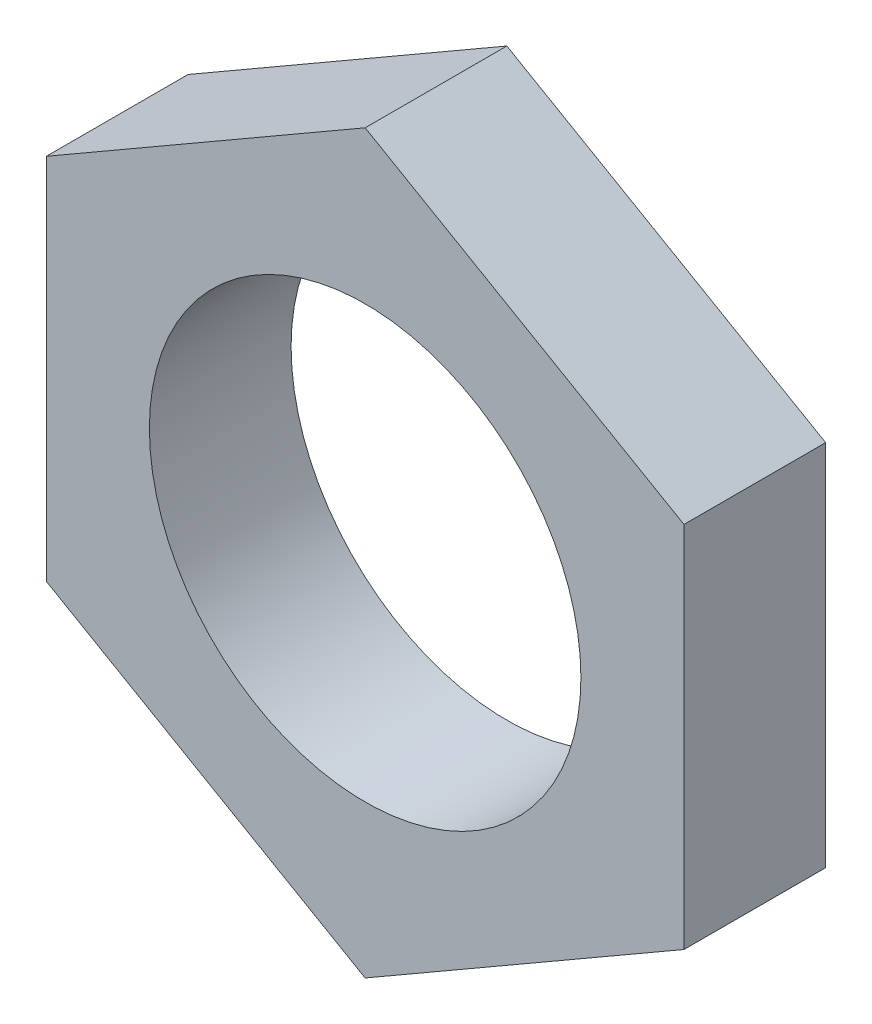
ISO-10303-21;
HEADER;
FILE_DESCRIPTION(('STEP AP214'),'2;1');
FILE_NAME('part.step','',(''),(''),'','','');
FILE_SCHEMA(('AUTOMOTIVE_DESIGN { 1 0 10303 214 1 1 1 1 }'));
ENDSEC;
DATA;
#1=APPLICATION_CONTEXT('core data for automotive mechanical design processes');
#2=APPLICATION_PROTOCOL_DEFINITION('international standard','automotive_design',2000,#1);
#3=PRODUCT_CONTEXT('',#1,'mechanical');
#4=PRODUCT('Part','Part','',(#3));
#5=PRODUCT_RELATED_PRODUCT_CATEGORY('part','',(#4));
#6=PRODUCT_DEFINITION_FORMATION('','',#4);
#7=PRODUCT_DEFINITION_CONTEXT('part definition',#1,'design');
#8=PRODUCT_DEFINITION('design','',#6,#7);
#9=PRODUCT_DEFINITION_SHAPE('','',#8);
#10=(LENGTH_UNIT() NAMED_UNIT(*) SI_UNIT(.MILLI.,.METRE.));
#11=(NAMED_UNIT(*) PLANE_ANGLE_UNIT() SI_UNIT($,.RADIAN.));
#12=(NAMED_UNIT(*) SI_UNIT($,.STERADIAN.) SOLID_ANGLE_UNIT());
#13=UNCERTAINTY_MEASURE_WITH_UNIT(LENGTH_MEASURE(1.E-05),#10,'distance_accuracy_value','');
#14=(GEOMETRIC_REPRESENTATION_CONTEXT(3) GLOBAL_UNCERTAINTY_ASSIGNED_CONTEXT((#13)) GLOBAL_UNIT_ASSIGNED_CONTEXT((#10,
#11,#12)) REPRESENTATION_CONTEXT('',''));
#15=CARTESIAN_POINT('',(0.,0.,0.));
#16=DIRECTION('',(0.,0.,1.));
#17=DIRECTION('',(1.,0.,0.));
#18=AXIS2_PLACEMENT_3D('',#15,#16,#17);
#19=CARTESIAN_POINT('',(0.,0.,2.2));
#20=DIRECTION('',(0.,0.,1.));
#21=DIRECTION('',(1.,0.,0.));
#22=AXIS2_PLACEMENT_3D('',#19,#20,#21);
#23=PLANE('',#22);
#24=DIRECTION('',(0.,1.,0.));
#25=VECTOR('',#24,1.);
#26=CARTESIAN_POINT('',(4.95,-2.85788383248865,2.2));
#27=LINE('',#26,#25);
#28=CARTESIAN_POINT('',(4.95,-2.85788383248865,2.2));
#29=VERTEX_POINT('',#28);
#30=CARTESIAN_POINT('',(4.95,2.85788383248865,2.2));
#31=VERTEX_POINT('',#30);
#32=EDGE_CURVE('E137',#29,#31,#27,.T.);
#33=ORIENTED_EDGE('',*,*,#32,.T.);
#34=DIRECTION('',(-0.866025403784439,0.5,0.));
#35=VECTOR('',#34,1.);
#36=CARTESIAN_POINT('',(4.95,2.85788383248865,2.2));
#37=LINE('',#36,#35);
#38=CARTESIAN_POINT('',(0.,5.7157676649773,2.2));
#39=VERTEX_POINT('',#38);
#40=EDGE_CURVE('E95',#31,#39,#37,.T.);
#41=ORIENTED_EDGE('',*,*,#40,.T.);
#42=DIRECTION('',(-0.866025403784438,-0.5,0.));
#43=VECTOR('',#42,1.);
#44=CARTESIAN_POINT('',(0.,5.7157676649773,2.2));
#45=LINE('',#44,#43);
#46=CARTESIAN_POINT('',(-4.95,2.85788383248865,2.2));
#47=VERTEX_POINT('',#46);
#48=EDGE_CURVE('E108',#39,#47,#45,.T.);
#49=ORIENTED_EDGE('',*,*,#48,.T.);
#50=DIRECTION('',(0.,-1.,0.));
#51=VECTOR('',#50,1.);
#52=CARTESIAN_POINT('',(-4.95,2.85788383248865,2.2));
#53=LINE('',#52,#51);
#54=CARTESIAN_POINT('',(-4.95,-2.85788383248865,2.2));
#55=VERTEX_POINT('',#54);
#56=EDGE_CURVE('E102',#47,#55,#53,.T.);
#57=ORIENTED_EDGE('',*,*,#56,.T.);
#58=DIRECTION('',(0.866025403784439,-0.5,0.));
#59=VECTOR('',#58,1.);
#60=CARTESIAN_POINT('',(-4.95,-2.85788383248865,2.2));
#61=LINE('',#60,#59);
#62=CARTESIAN_POINT('',(0.,-5.7157676649773,2.2));
#63=VERTEX_POINT('',#62);
#64=EDGE_CURVE('E106',#55,#63,#61,.T.);
#65=ORIENTED_EDGE('',*,*,#64,.T.);
#66=DIRECTION('',(0.866025403784439,0.5,0.));
#67=VECTOR('',#66,1.);
#68=CARTESIAN_POINT('',(0.,-5.7157676649773,2.2));
#69=LINE('',#68,#67);
#70=EDGE_CURVE('E58',#63,#29,#69,.T.);
#71=ORIENTED_EDGE('',*,*,#70,.T.);
#72=EDGE_LOOP('',(#33,#41,#49,#57,#65,#71));
#73=FACE_BOUND('',#72,.T.);
#74=CARTESIAN_POINT('',(0.,0.,2.2));
#75=DIRECTION('',(0.,0.,1.));
#76=DIRECTION('',(1.,0.,0.));
#77=AXIS2_PLACEMENT_3D('',#74,#75,#76);
#78=CIRCLE('',#77,3.35);
#79=CARTESIAN_POINT('',(3.35,0.,2.2));
#80=VERTEX_POINT('',#79);
#81=EDGE_CURVE('E130',#80,#80,#78,.T.);
#82=ORIENTED_EDGE('',*,*,#81,.F.);
#83=EDGE_LOOP('',(#82));
#84=FACE_BOUND('',#83,.T.);
#85=ADVANCED_FACE('F41',(#73,#84),#23,.T.);
#86=CARTESIAN_POINT('',(0.,0.,0.));
#87=DIRECTION('',(0.,0.,1.));
#88=DIRECTION('',(1.,0.,0.));
#89=AXIS2_PLACEMENT_3D('',#86,#87,#88);
#90=PLANE('',#89);
#91=DIRECTION('',(0.,1.,0.));
#92=VECTOR('',#91,1.);
#93=CARTESIAN_POINT('',(4.95,-2.85788383248865,0.));
#94=LINE('',#93,#92);
#95=CARTESIAN_POINT('',(4.95,-2.85788383248865,0.));
#96=VERTEX_POINT('',#95);
#97=CARTESIAN_POINT('',(4.95,2.85788383248865,0.));
#98=VERTEX_POINT('',#97);
#99=EDGE_CURVE('E126',#96,#98,#94,.T.);
#100=ORIENTED_EDGE('',*,*,#99,.F.);
#101=DIRECTION('',(0.866025403784439,0.5,0.));
#102=VECTOR('',#101,1.);
#103=CARTESIAN_POINT('',(0.,-5.7157676649773,0.));
#104=LINE('',#103,#102);
#105=CARTESIAN_POINT('',(0.,-5.7157676649773,0.));
#106=VERTEX_POINT('',#105);
#107=EDGE_CURVE('E87',#106,#96,#104,.T.);
#108=ORIENTED_EDGE('',*,*,#107,.F.);
#109=DIRECTION('',(0.866025403784439,-0.5,0.));
#110=VECTOR('',#109,1.);
#111=CARTESIAN_POINT('',(-4.95,-2.85788383248865,0.));
#112=LINE('',#111,#110);
#113=CARTESIAN_POINT('',(-4.95,-2.85788383248865,0.));
#114=VERTEX_POINT('',#113);
#115=EDGE_CURVE('E81',#114,#106,#112,.T.);
#116=ORIENTED_EDGE('',*,*,#115,.F.);
#117=DIRECTION('',(0.,-1.,0.));
#118=VECTOR('',#117,1.);
#119=CARTESIAN_POINT('',(-4.95,2.85788383248865,0.));
#120=LINE('',#119,#118);
#121=CARTESIAN_POINT('',(-4.95,2.85788383248865,0.));
#122=VERTEX_POINT('',#121);
#123=EDGE_CURVE('E116',#122,#114,#120,.T.);
#124=ORIENTED_EDGE('',*,*,#123,.F.);
#125=DIRECTION('',(-0.866025403784438,-0.5,0.));
#126=VECTOR('',#125,1.);
#127=CARTESIAN_POINT('',(0.,5.7157676649773,0.));
#128=LINE('',#127,#126);
#129=CARTESIAN_POINT('',(0.,5.7157676649773,0.));
#130=VERTEX_POINT('',#129);
#131=EDGE_CURVE('E132',#130,#122,#128,.T.);
#132=ORIENTED_EDGE('',*,*,#131,.F.);
#133=DIRECTION('',(-0.866025403784439,0.5,0.));
#134=VECTOR('',#133,1.);
#135=CARTESIAN_POINT('',(4.95,2.85788383248865,0.));
#136=LINE('',#135,#134);
#137=EDGE_CURVE('E129',#98,#130,#136,.T.);
#138=ORIENTED_EDGE('',*,*,#137,.F.);
#139=EDGE_LOOP('',(#100,#108,#116,#124,#132,#138));
#140=FACE_BOUND('',#139,.T.);
#141=CARTESIAN_POINT('',(0.,0.,0.));
#142=DIRECTION('',(0.,0.,1.));
#143=DIRECTION('',(1.,0.,0.));
#144=AXIS2_PLACEMENT_3D('',#141,#142,#143);
#145=CIRCLE('',#144,3.35);
#146=CARTESIAN_POINT('',(3.35,0.,0.));
#147=VERTEX_POINT('',#146);
#148=EDGE_CURVE('E236',#147,#147,#145,.T.);
#149=ORIENTED_EDGE('',*,*,#148,.T.);
#150=EDGE_LOOP('',(#149));
#151=FACE_BOUND('',#150,.T.);
#152=ADVANCED_FACE('F146',(#140,#151),#90,.F.);
#153=CARTESIAN_POINT('',(4.95,-2.85788383248865,2.2));
#154=DIRECTION('',(-1.,0.,0.));
#155=DIRECTION('',(0.,-1.,0.));
#156=AXIS2_PLACEMENT_3D('',#153,#154,#155);
#157=PLANE('',#156);
#158=ORIENTED_EDGE('',*,*,#99,.T.);
#159=DIRECTION('',(0.,0.,-1.));
#160=VECTOR('',#159,1.);
#161=CARTESIAN_POINT('',(4.95,2.85788383248865,2.2));
#162=LINE('',#161,#160);
#163=EDGE_CURVE('E11',#31,#98,#162,.T.);
#164=ORIENTED_EDGE('',*,*,#163,.F.);
#165=ORIENTED_EDGE('',*,*,#32,.F.);
#166=DIRECTION('',(0.,0.,-1.));
#167=VECTOR('',#166,1.);
#168=CARTESIAN_POINT('',(4.95,-2.85788383248865,2.2));
#169=LINE('',#168,#167);
#170=EDGE_CURVE('E122',#29,#96,#169,.T.);
#171=ORIENTED_EDGE('',*,*,#170,.T.);
#172=EDGE_LOOP('',(#158,#164,#165,#171));
#173=FACE_BOUND('',#172,.T.);
#174=ADVANCED_FACE('F43',(#173),#157,.F.);
#175=CARTESIAN_POINT('',(4.95,2.85788383248865,2.2));
#176=DIRECTION('',(-0.5,-0.866025403784439,0.));
#177=DIRECTION('',(0.866025403784439,-0.5,0.));
#178=AXIS2_PLACEMENT_3D('',#175,#176,#177);
#179=PLANE('',#178);
#180=ORIENTED_EDGE('',*,*,#137,.T.);
#181=DIRECTION('',(0.,0.,-1.));
#182=VECTOR('',#181,1.);
#183=CARTESIAN_POINT('',(0.,5.7157676649773,2.2));
#184=LINE('',#183,#182);
#185=EDGE_CURVE('E50',#39,#130,#184,.T.);
#186=ORIENTED_EDGE('',*,*,#185,.F.);
#187=ORIENTED_EDGE('',*,*,#40,.F.);
#188=ORIENTED_EDGE('',*,*,#163,.T.);
#189=EDGE_LOOP('',(#180,#186,#187,#188));
#190=FACE_BOUND('',#189,.T.);
#191=ADVANCED_FACE('F171',(#190),#179,.F.);
#192=CARTESIAN_POINT('',(0.,5.7157676649773,2.2));
#193=DIRECTION('',(0.5,-0.866025403784439,0.));
#194=DIRECTION('',(0.866025403784438,0.5,0.));
#195=AXIS2_PLACEMENT_3D('',#192,#193,#194);
#196=PLANE('',#195);
#197=ORIENTED_EDGE('',*,*,#131,.T.);
#198=DIRECTION('',(0.,0.,-1.));
#199=VECTOR('',#198,1.);
#200=CARTESIAN_POINT('',(-4.95,2.85788383248865,2.2));
#201=LINE('',#200,#199);
#202=EDGE_CURVE('E117',#47,#122,#201,.T.);
#203=ORIENTED_EDGE('',*,*,#202,.F.);
#204=ORIENTED_EDGE('',*,*,#48,.F.);
#205=ORIENTED_EDGE('',*,*,#185,.T.);
#206=EDGE_LOOP('',(#197,#203,#204,#205));
#207=FACE_BOUND('',#206,.T.);
#208=ADVANCED_FACE('F143',(#207),#196,.F.);
#209=CARTESIAN_POINT('',(-4.95,2.85788383248865,2.2));
#210=DIRECTION('',(1.,0.,0.));
#211=DIRECTION('',(0.,1.,0.));
#212=AXIS2_PLACEMENT_3D('',#209,#210,#211);
#213=PLANE('',#212);
#214=ORIENTED_EDGE('',*,*,#123,.T.);
#215=DIRECTION('',(0.,0.,-1.));
#216=VECTOR('',#215,1.);
#217=CARTESIAN_POINT('',(-4.95,-2.85788383248865,2.2));
#218=LINE('',#217,#216);
#219=EDGE_CURVE('E113',#55,#114,#218,.T.);
#220=ORIENTED_EDGE('',*,*,#219,.F.);
#221=ORIENTED_EDGE('',*,*,#56,.F.);
#222=ORIENTED_EDGE('',*,*,#202,.T.);
#223=EDGE_LOOP('',(#214,#220,#221,#222));
#224=FACE_BOUND('',#223,.T.);
#225=ADVANCED_FACE('F114',(#224),#213,.F.);
#226=CARTESIAN_POINT('',(-4.95,-2.85788383248865,2.2));
#227=DIRECTION('',(0.5,0.866025403784439,0.));
#228=DIRECTION('',(-0.866025403784439,0.5,0.));
#229=AXIS2_PLACEMENT_3D('',#226,#227,#228);
#230=PLANE('',#229);
#231=ORIENTED_EDGE('',*,*,#115,.T.);
#232=DIRECTION('',(0.,0.,-1.));
#233=VECTOR('',#232,1.);
#234=CARTESIAN_POINT('',(0.,-5.7157676649773,2.2));
#235=LINE('',#234,#233);
#236=EDGE_CURVE('E118',#63,#106,#235,.T.);
#237=ORIENTED_EDGE('',*,*,#236,.F.);
#238=ORIENTED_EDGE('',*,*,#64,.F.);
#239=ORIENTED_EDGE('',*,*,#219,.T.);
#240=EDGE_LOOP('',(#231,#237,#238,#239));
#241=FACE_BOUND('',#240,.T.);
#242=ADVANCED_FACE('F120',(#241),#230,.F.);
#243=CARTESIAN_POINT('',(0.,-5.7157676649773,2.2));
#244=DIRECTION('',(-0.5,0.866025403784439,0.));
#245=DIRECTION('',(-0.866025403784439,-0.5,0.));
#246=AXIS2_PLACEMENT_3D('',#243,#244,#245);
#247=PLANE('',#246);
#248=ORIENTED_EDGE('',*,*,#107,.T.);
#249=ORIENTED_EDGE('',*,*,#170,.F.);
#250=ORIENTED_EDGE('',*,*,#70,.F.);
#251=ORIENTED_EDGE('',*,*,#236,.T.);
#252=EDGE_LOOP('',(#248,#249,#250,#251));
#253=FACE_BOUND('',#252,.T.);
#254=ADVANCED_FACE('F151',(#253),#247,.F.);
#255=CARTESIAN_POINT('',(0.,0.,2.2));
#256=DIRECTION('',(0.,0.,-1.));
#257=DIRECTION('',(-1.,0.,0.));
#258=AXIS2_PLACEMENT_3D('',#255,#256,#257);
#259=CYLINDRICAL_SURFACE('',#258,3.35);
#260=ORIENTED_EDGE('',*,*,#81,.T.);
#261=EDGE_LOOP('',(#260));
#262=FACE_BOUND('',#261,.T.);
#263=ORIENTED_EDGE('',*,*,#148,.F.);
#264=EDGE_LOOP('',(#263));
#265=FACE_BOUND('',#264,.T.);
#266=ADVANCED_FACE('F153',(#262,#265),#259,.F.);
#267=CLOSED_SHELL('',(#85,#152,#174,#191,#208,#225,#242,#254,#266));
#268=MANIFOLD_SOLID_BREP('B2',#267);
#269=ADVANCED_BREP_SHAPE_REPRESENTATION('',(#18,#268),#14);
#270=SHAPE_DEFINITION_REPRESENTATION(#9,#269);
ENDSEC;
END-ISO-10303-21;
